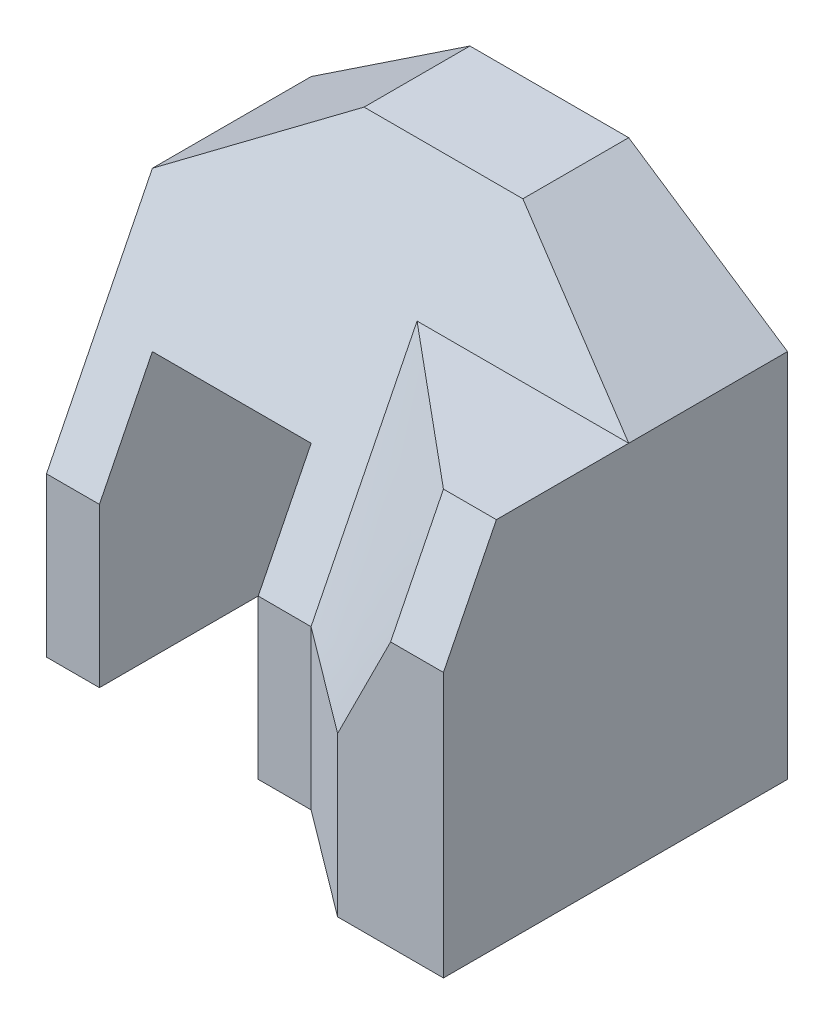
ISO-10303-21;
HEADER;
FILE_DESCRIPTION(('STEP AP214'),'2;1');
FILE_NAME('part.step','',(''),(''),'','','');
FILE_SCHEMA(('AUTOMOTIVE_DESIGN { 1 0 10303 214 1 1 1 1 }'));
ENDSEC;
DATA;
#1=APPLICATION_CONTEXT('core data for automotive mechanical design processes');
#2=APPLICATION_PROTOCOL_DEFINITION('international standard','automotive_design',2000,#1);
#3=PRODUCT_CONTEXT('',#1,'mechanical');
#4=PRODUCT('Part','Part','',(#3));
#5=PRODUCT_RELATED_PRODUCT_CATEGORY('part','',(#4));
#6=PRODUCT_DEFINITION_FORMATION('','',#4);
#7=PRODUCT_DEFINITION_CONTEXT('part definition',#1,'design');
#8=PRODUCT_DEFINITION('design','',#6,#7);
#9=PRODUCT_DEFINITION_SHAPE('','',#8);
#10=(LENGTH_UNIT() NAMED_UNIT(*) SI_UNIT(.MILLI.,.METRE.));
#11=(NAMED_UNIT(*) PLANE_ANGLE_UNIT() SI_UNIT($,.RADIAN.));
#12=(NAMED_UNIT(*) SI_UNIT($,.STERADIAN.) SOLID_ANGLE_UNIT());
#13=UNCERTAINTY_MEASURE_WITH_UNIT(LENGTH_MEASURE(1.E-05),#10,'distance_accuracy_value','');
#14=(GEOMETRIC_REPRESENTATION_CONTEXT(3) GLOBAL_UNCERTAINTY_ASSIGNED_CONTEXT((#13)) GLOBAL_UNIT_ASSIGNED_CONTEXT((#10,
#11,#12)) REPRESENTATION_CONTEXT('',''));
#15=CARTESIAN_POINT('',(0.,0.,0.));
#16=DIRECTION('',(0.,0.,1.));
#17=DIRECTION('',(1.,0.,0.));
#18=AXIS2_PLACEMENT_3D('',#15,#16,#17);
#19=CARTESIAN_POINT('',(0.5,0.5,4.0000538119005));
#20=DIRECTION('',(0.,0.,1.));
#21=DIRECTION('',(0.,-1.,0.));
#22=AXIS2_PLACEMENT_3D('',#19,#20,#21);
#23=PLANE('',#22);
#24=DIRECTION('',(0.,-1.,0.));
#25=VECTOR('',#24,1.);
#26=CARTESIAN_POINT('',(2.5,-0.5,4.0000538119005));
#27=LINE('',#26,#25);
#28=CARTESIAN_POINT('',(2.4999927075767,-1.49874744849598,4.00005671380062));
#29=VERTEX_POINT('',#28);
#30=CARTESIAN_POINT('',(2.5,-4.5,4.0000538119005));
#31=VERTEX_POINT('',#30);
#32=EDGE_CURVE('E185',#29,#31,#27,.T.);
#33=ORIENTED_EDGE('',*,*,#32,.T.);
#34=DIRECTION('',(1.,0.,0.));
#35=VECTOR('',#34,1.);
#36=CARTESIAN_POINT('',(0.5,-4.5,4.0000538119005));
#37=LINE('',#36,#35);
#38=CARTESIAN_POINT('',(4.5,-4.5,4.0000538119005));
#39=VERTEX_POINT('',#38);
#40=EDGE_CURVE('E184',#31,#39,#37,.T.);
#41=ORIENTED_EDGE('',*,*,#40,.T.);
#42=DIRECTION('',(0.,-1.,0.));
#43=VECTOR('',#42,1.);
#44=CARTESIAN_POINT('',(4.5,0.5,4.0000538119005));
#45=LINE('',#44,#43);
#46=CARTESIAN_POINT('',(4.5,0.5,4.0000538119005));
#47=VERTEX_POINT('',#46);
#48=EDGE_CURVE('E301',#47,#39,#45,.T.);
#49=ORIENTED_EDGE('',*,*,#48,.F.);
#50=DIRECTION('',(1.,0.,0.));
#51=VECTOR('',#50,1.);
#52=CARTESIAN_POINT('',(0.5,0.5,4.0000538119005));
#53=LINE('',#52,#51);
#54=CARTESIAN_POINT('',(3.50087116083465,0.499961528603174,3.99997320546575));
#55=VERTEX_POINT('',#54);
#56=EDGE_CURVE('E255',#55,#47,#53,.T.);
#57=ORIENTED_EDGE('',*,*,#56,.F.);
#58=CARTESIAN_POINT('',(2.49958350428957,-1.4997570487343,4.00056285003889));
#59=CARTESIAN_POINT('',(2.54149641947536,-1.41656131667034,4.0002647448763));
#60=CARTESIAN_POINT('',(2.58332355642664,-1.33332224784875,4.00006830762727));
#61=CARTESIAN_POINT('',(2.66686287394525,-1.1667770529191,3.99981593232635));
#62=CARTESIAN_POINT('',(2.70857504409917,-1.08347092156603,3.99976000660928));
#63=CARTESIAN_POINT('',(2.79193598144681,-0.916821249116581,3.99972584707898));
#64=CARTESIAN_POINT('',(2.83358474502591,-0.83347770621413,3.99974761754043));
#65=CARTESIAN_POINT('',(2.91683555384636,-0.666763306704454,3.99984828655163));
#66=CARTESIAN_POINT('',(2.95843759722138,-0.583392449166699,3.99992718730757));
#67=CARTESIAN_POINT('',(3.04160691534012,-0.416630814851586,4.00012731149325));
#68=CARTESIAN_POINT('',(3.08317418918512,-0.333240037626857,4.00024853598502));
#69=CARTESIAN_POINT('',(3.16631123059478,-0.166460721498398,4.00048756639654));
#70=CARTESIAN_POINT('',(3.20788099813492,-0.0830721825815888,4.00060537234566));
#71=CARTESIAN_POINT('',(3.29110568429374,0.0836538002768182,4.00073623927426));
#72=CARTESIAN_POINT('',(3.33276059509661,0.166991248069248,4.00074930947104));
#73=CARTESIAN_POINT('',(3.41637748907368,0.333487028918499,4.00040015168831));
#74=CARTESIAN_POINT('',(3.4583394002091,0.416645398421039,4.00003800911597));
#75=CARTESIAN_POINT('',(3.50057335062451,0.499665551753779,3.99935306678541));
#76=B_SPLINE_CURVE_WITH_KNOTS('',3,(#58,#59,#60,#61,#62,#63,#64,#65,#66,#67,#68,#69,#70,#71,#72,
#73,#74,#75),.UNSPECIFIED.,.F.,.F.,(4,2,2,2,2,2,2,2,4),(0.,0.279471952475803,0.558968437544278,
0.838480300176707,1.11800295731927,1.3975326291114,1.67705989800465,1.95656256669659,
2.23600162804104),.UNSPECIFIED.);
#77=EDGE_CURVE('E400',#55,#29,#76,.F.);
#78=ORIENTED_EDGE('',*,*,#77,.T.);
#79=EDGE_LOOP('',(#33,#41,#49,#57,#78));
#80=FACE_BOUND('',#79,.T.);
#81=ADVANCED_FACE('F33',(#80),#23,.T.);
#82=CARTESIAN_POINT('',(0.5,2.5,3.0000538119005));
#83=DIRECTION('',(0.,0.447213595499958,0.894427190999916));
#84=DIRECTION('',(0.,-0.894427190999916,0.447213595499958));
#85=AXIS2_PLACEMENT_3D('',#82,#83,#84);
#86=PLANE('',#85);
#87=DIRECTION('',(1.,0.,0.));
#88=VECTOR('',#87,1.);
#89=CARTESIAN_POINT('',(0.5,2.5,3.0000538119005));
#90=LINE('',#89,#88);
#91=CARTESIAN_POINT('',(3.49970849320657,2.50001145009092,3.00007780244424));
#92=VERTEX_POINT('',#91);
#93=CARTESIAN_POINT('',(4.5,2.5,3.0000538119005));
#94=VERTEX_POINT('',#93);
#95=EDGE_CURVE('E250',#92,#94,#90,.T.);
#96=ORIENTED_EDGE('',*,*,#95,.F.);
#97=CARTESIAN_POINT('',(3.5005733506245,0.499665551753777,3.99935306678541));
#98=CARTESIAN_POINT('',(3.49986743317037,0.583416434472831,3.95854628151296));
#99=CARTESIAN_POINT('',(3.49956574355038,0.666924741373819,3.91724884215407));
#100=CARTESIAN_POINT('',(3.49938095115662,0.833697184507774,3.83414236932439));
#101=CARTESIAN_POINT('',(3.49949788610719,0.916961298058577,3.79233329008554));
#102=CARTESIAN_POINT('',(3.49976046344427,1.08347304955096,3.70867991054064));
#103=CARTESIAN_POINT('',(3.49990610642543,1.1667206871155,3.66683560952288));
#104=CARTESIAN_POINT('',(3.50008517149017,1.33328256351635,3.58328359292611));
#105=CARTESIAN_POINT('',(3.50011859604767,1.41659680084393,3.54157587435632));
#106=CARTESIAN_POINT('',(3.50015611184294,1.58324203151882,3.45819646557547));
#107=CARTESIAN_POINT('',(3.50016020340609,1.66657302467001,3.41652477496992));
#108=CARTESIAN_POINT('',(3.50015633309681,1.83324196425395,3.33319616426182));
#109=CARTESIAN_POINT('',(3.50014837127765,1.91657991065433,3.29153924409482));
#110=CARTESIAN_POINT('',(3.50011039051209,2.08326864846417,3.20825237253051));
#111=CARTESIAN_POINT('',(3.50008037169786,2.16661943979366,3.16662242097311));
#112=CARTESIAN_POINT('',(3.49998219005013,2.33334327272151,3.08340913720679));
#113=CARTESIAN_POINT('',(3.49991402757998,2.41671631410034,3.04182580455757));
#114=CARTESIAN_POINT('',(3.4998187497045,2.50010572735229,3.00027533474143));
#115=B_SPLINE_CURVE_WITH_KNOTS('',3,(#97,#98,#99,#100,#101,#102,#103,#104,#105,#106,#107,#108,
#109,#110,#111,#112,#113,#114),.UNSPECIFIED.,.F.,.F.,(4,2,2,2,2,2,2,2,4),(0.,0.279487304548323,
0.558999795717704,0.838518077312864,1.11803019674219,1.39753921569574,1.67704699949379,
1.95655310846118,2.2360565549171),.UNSPECIFIED.);
#116=EDGE_CURVE('E342',#92,#55,#115,.F.);
#117=ORIENTED_EDGE('',*,*,#116,.T.);
#118=ORIENTED_EDGE('',*,*,#56,.T.);
#119=DIRECTION('',(0.,-0.894427190999916,0.447213595499958));
#120=VECTOR('',#119,1.);
#121=CARTESIAN_POINT('',(4.5,2.5,3.0000538119005));
#122=LINE('',#121,#120);
#123=EDGE_CURVE('E447',#94,#47,#122,.T.);
#124=ORIENTED_EDGE('',*,*,#123,.F.);
#125=EDGE_LOOP('',(#96,#117,#118,#124));
#126=FACE_BOUND('',#125,.T.);
#127=ADVANCED_FACE('F318',(#126),#86,.T.);
#128=CARTESIAN_POINT('',(0.5,2.5,0.500000000000001));
#129=DIRECTION('',(0.,1.,0.));
#130=DIRECTION('',(0.,0.,1.));
#131=AXIS2_PLACEMENT_3D('',#128,#129,#130);
#132=PLANE('',#131);
#133=CARTESIAN_POINT('',(3.4002341453916,2.50000331944349,2.91692550743889));
#134=CARTESIAN_POINT('',(3.35551781353747,2.49996711745501,2.87953352486206));
#135=CARTESIAN_POINT('',(3.31078156584035,2.49994238853837,2.8421653748496));
#136=CARTESIAN_POINT('',(3.22128016192815,2.49990979368912,2.76746440660837));
#137=CARTESIAN_POINT('',(3.17651500594038,2.49990192762549,2.73013158810733));
#138=CARTESIAN_POINT('',(3.08696622391711,2.49989697496073,2.65548854434524));
#139=CARTESIAN_POINT('',(3.04218259796945,2.49989988830892,2.6181783189788));
#140=CARTESIAN_POINT('',(2.95260480996369,2.49991186321713,2.54357075338038));
#141=CARTESIAN_POINT('',(2.90781064793283,2.49992092476143,2.50627341311568));
#142=CARTESIAN_POINT('',(2.8182180563226,2.49994153925452,2.43168395557095));
#143=CARTESIAN_POINT('',(2.77341962674776,2.4999530922007,2.39439183828548));
#144=CARTESIAN_POINT('',(2.68382303888505,2.49997604120783,2.31980727695089));
#145=CARTESIAN_POINT('',(2.63902488059718,2.49998743726879,2.28251483290178));
#146=CARTESIAN_POINT('',(2.54943197228685,2.50000824276492,2.20792578450191));
#147=CARTESIAN_POINT('',(2.50463722226686,2.50001765219866,2.17062918014817));
#148=CARTESIAN_POINT('',(2.41505267253215,2.50003358344229,2.09602992121213));
#149=CARTESIAN_POINT('',(2.3702628728232,2.50004010524885,2.05872726662291));
#150=CARTESIAN_POINT('',(2.32547635478394,2.50004473273555,2.02142067150619));
#151=B_SPLINE_CURVE_WITH_KNOTS('',3,(#133,#134,#135,#136,#137,#138,#139,#140,#141,#142,#143,
#144,#145,#146,#147,#148,#149,#150),.UNSPECIFIED.,.F.,.F.,(4,2,2,2,2,2,2,2,4),(0.,
0.174869655202873,0.349737951676011,0.524605425960433,0.699472452921211,0.874339296478271,
1.04920614143477,1.22407311240975,1.39894028495571),.UNSPECIFIED.);
#152=CARTESIAN_POINT('',(2.32553449668896,2.50001118319096,2.02135090023035));
#153=VERTEX_POINT('',#152);
#154=CARTESIAN_POINT('',(3.40018828035431,2.4999998757176,2.91698054848424));
#155=VERTEX_POINT('',#154);
#156=EDGE_CURVE('E366',#153,#155,#151,.F.);
#157=ORIENTED_EDGE('',*,*,#156,.T.);
#158=CARTESIAN_POINT('',(3.49981743585071,2.50010572569796,3.0002742340101));
#159=CARTESIAN_POINT('',(3.49566977331897,2.50010050323937,2.99679937097509));
#160=CARTESIAN_POINT('',(3.49152188772414,2.50009540903627,2.99332477400411));
#161=CARTESIAN_POINT('',(3.48322568826343,2.50008547045015,2.98637610349199));
#162=CARTESIAN_POINT('',(3.47907737439819,2.50008062606677,2.98290202995009));
#163=CARTESIAN_POINT('',(3.47078032988359,2.50007118042048,2.97595439226038));
#164=CARTESIAN_POINT('',(3.46663159923482,2.50006657915723,2.97248082811185));
#165=CARTESIAN_POINT('',(3.45833373244222,2.50005761316575,2.96553419541041));
#166=CARTESIAN_POINT('',(3.45418459629896,2.50005324843719,2.96206112685683));
#167=CARTESIAN_POINT('',(3.44588592966463,2.50004474901272,2.95511547172138));
#168=CARTESIAN_POINT('',(3.44173639917411,2.50004061431649,2.95164288513889));
#169=CARTESIAN_POINT('',(3.43343695483206,2.50003256854773,2.94469818051729));
#170=CARTESIAN_POINT('',(3.42928704098103,2.5000286574749,2.94122606247759));
#171=CARTESIAN_POINT('',(3.42098684076291,2.50002105262705,2.93428228168769));
#172=CARTESIAN_POINT('',(3.41683655439628,2.50001735885177,2.93081061893694));
#173=CARTESIAN_POINT('',(3.40853561979444,2.50001018238722,2.92386773570866));
#174=CARTESIAN_POINT('',(3.40438497155966,2.50000669969771,2.92039651523063));
#175=CARTESIAN_POINT('',(3.4002341453916,2.50000331944349,2.91692550743889));
#176=B_SPLINE_CURVE_WITH_KNOTS('',3,(#158,#159,#160,#161,#162,#163,#164,#165,#166,#167,#168,
#169,#170,#171,#172,#173,#174,#175),.UNSPECIFIED.,.F.,.F.,(4,2,2,2,2,2,2,2,4),(0.,
0.0162326905725323,0.0324653571359733,0.0486980006090778,0.064930621879698,0.0811632218057955,
0.097395801216407,0.113628360912604,0.129860901668391),.UNSPECIFIED.);
#177=EDGE_CURVE('E357',#155,#92,#176,.F.);
#178=ORIENTED_EDGE('',*,*,#177,.T.);
#179=ORIENTED_EDGE('',*,*,#95,.T.);
#180=DIRECTION('',(0.,0.,1.));
#181=VECTOR('',#180,1.);
#182=CARTESIAN_POINT('',(4.5,2.5,0.500000000000001));
#183=LINE('',#182,#181);
#184=CARTESIAN_POINT('',(4.5,2.5,0.500000000000001));
#185=VERTEX_POINT('',#184);
#186=EDGE_CURVE('E403',#185,#94,#183,.T.);
#187=ORIENTED_EDGE('',*,*,#186,.F.);
#188=DIRECTION('',(1.,0.,0.));
#189=VECTOR('',#188,1.);
#190=CARTESIAN_POINT('',(0.5,2.5,0.500000000000001));
#191=LINE('',#190,#189);
#192=CARTESIAN_POINT('',(0.501351919989517,2.50000853869827,0.499995730650865));
#193=VERTEX_POINT('',#192);
#194=EDGE_CURVE('E174',#193,#185,#191,.T.);
#195=ORIENTED_EDGE('',*,*,#194,.F.);
#196=CARTESIAN_POINT('',(2.32547635478394,2.50004473273555,2.02142067150619));
#197=CARTESIAN_POINT('',(2.24939694099326,2.50005325284452,1.95804981899506));
#198=CARTESIAN_POINT('',(2.17332758276244,2.50005597006414,1.8946668977488));
#199=CARTESIAN_POINT('',(2.02120302848641,2.50005314338351,1.76788374633175));
#200=CARTESIAN_POINT('',(1.94514783247041,2.50004759946641,1.70448351612591));
#201=CARTESIAN_POINT('',(1.79304587495392,2.5000315951544,1.57767275966668));
#202=CARTESIAN_POINT('',(1.71699911346341,2.50002113475372,1.51426223340131));
#203=CARTESIAN_POINT('',(1.56490548075494,2.50000027689608,1.38744131123372));
#204=CARTESIAN_POINT('',(1.48885860953697,2.49998987943913,1.32403091533151));
#205=CARTESIAN_POINT('',(1.33675715739893,2.49997357886892,1.19721953605873));
#206=CARTESIAN_POINT('',(1.26070257648726,2.49996767575082,1.13381855267809));
#207=CARTESIAN_POINT('',(1.10858047969692,2.49996341100161,1.00703238166271));
#208=CARTESIAN_POINT('',(1.03251296384169,2.49996504935699,0.943647193999868));
#209=CARTESIAN_POINT('',(0.880362968031575,2.49997704966812,0.816895089037596));
#210=CARTESIAN_POINT('',(0.804280488106648,2.49998741160659,0.753528171702209));
#211=CARTESIAN_POINT('',(0.652103777877846,2.50001498974235,0.626808698261892));
#212=CARTESIAN_POINT('',(0.576009547593082,2.50003220592861,0.56345614213401));
#213=CARTESIAN_POINT('',(0.499911001869605,2.50005191460052,0.500108772891251));
#214=B_SPLINE_CURVE_WITH_KNOTS('',3,(#196,#197,#198,#199,#200,#201,#202,#203,#204,#205,#206,
#207,#208,#209,#210,#211,#212,#213),.UNSPECIFIED.,.F.,.F.,(4,2,2,2,2,2,2,2,4),(0.,
0.297044570667198,0.594089747462085,0.891135272555297,1.18818079979485,1.48522600703011,
1.78227068206009,2.07931476844007,2.37635837670744),.UNSPECIFIED.);
#215=EDGE_CURVE('E374',#193,#153,#214,.F.);
#216=ORIENTED_EDGE('',*,*,#215,.T.);
#217=EDGE_LOOP('',(#157,#178,#179,#187,#195,#216));
#218=FACE_BOUND('',#217,.T.);
#219=ADVANCED_FACE('F328',(#218),#132,.T.);
#220=CARTESIAN_POINT('',(0.,0.,2.5));
#221=DIRECTION('',(0.,0.,-1.));
#222=DIRECTION('',(-1.,0.,0.));
#223=AXIS2_PLACEMENT_3D('',#220,#221,#222);
#224=PLANE('',#223);
#225=DIRECTION('',(0.,1.,0.));
#226=VECTOR('',#225,1.);
#227=CARTESIAN_POINT('',(0.5,-4.5,2.5));
#228=LINE('',#227,#226);
#229=CARTESIAN_POINT('',(0.5,-4.5,2.5));
#230=VERTEX_POINT('',#229);
#231=CARTESIAN_POINT('',(0.5,-1.50031001702587,2.5018984009075));
#232=VERTEX_POINT('',#231);
#233=EDGE_CURVE('E164',#230,#232,#228,.T.);
#234=ORIENTED_EDGE('',*,*,#233,.T.);
#235=DIRECTION('',(-1.,0.,0.));
#236=VECTOR('',#235,1.);
#237=CARTESIAN_POINT('',(4.5,-1.5,2.5));
#238=LINE('',#237,#236);
#239=CARTESIAN_POINT('',(-0.499999999999999,-1.5,2.5));
#240=VERTEX_POINT('',#239);
#241=EDGE_CURVE('E242',#232,#240,#238,.T.);
#242=ORIENTED_EDGE('',*,*,#241,.T.);
#243=DIRECTION('',(0.,-1.,0.));
#244=VECTOR('',#243,1.);
#245=CARTESIAN_POINT('',(-0.499999999999999,0.500000000000001,2.5));
#246=LINE('',#245,#244);
#247=CARTESIAN_POINT('',(-0.499999999999998,-4.5,2.5));
#248=VERTEX_POINT('',#247);
#249=EDGE_CURVE('E60',#240,#248,#246,.T.);
#250=ORIENTED_EDGE('',*,*,#249,.T.);
#251=DIRECTION('',(1.,0.,0.));
#252=VECTOR('',#251,1.);
#253=CARTESIAN_POINT('',(-0.499999999999998,-4.5,2.5));
#254=LINE('',#253,#252);
#255=EDGE_CURVE('E182',#248,#230,#254,.T.);
#256=ORIENTED_EDGE('',*,*,#255,.T.);
#257=EDGE_LOOP('',(#234,#242,#250,#256));
#258=FACE_BOUND('',#257,.T.);
#259=ADVANCED_FACE('F187',(#258),#224,.F.);
#260=CARTESIAN_POINT('',(-4.5,-4.5,2.5));
#261=DIRECTION('',(1.,0.,0.));
#262=DIRECTION('',(0.,0.,-1.));
#263=AXIS2_PLACEMENT_3D('',#260,#261,#262);
#264=PLANE('',#263);
#265=DIRECTION('',(0.,-1.,0.));
#266=VECTOR('',#265,1.);
#267=CARTESIAN_POINT('',(-4.5,-4.5,2.5));
#268=LINE('',#267,#266);
#269=CARTESIAN_POINT('',(-4.5,-1.5,2.5));
#270=VERTEX_POINT('',#269);
#271=CARTESIAN_POINT('',(-4.5,-4.5,2.5));
#272=VERTEX_POINT('',#271);
#273=EDGE_CURVE('E104',#270,#272,#268,.T.);
#274=ORIENTED_EDGE('',*,*,#273,.F.);
#275=DIRECTION('',(0.,-0.894427190999916,0.447213595499958));
#276=VECTOR('',#275,1.);
#277=CARTESIAN_POINT('',(-4.5,-1.5,2.5));
#278=LINE('',#277,#276);
#279=CARTESIAN_POINT('',(-4.5,2.5,0.5));
#280=VERTEX_POINT('',#279);
#281=EDGE_CURVE('E52',#280,#270,#278,.T.);
#282=ORIENTED_EDGE('',*,*,#281,.F.);
#283=DIRECTION('',(0.,0.,-1.));
#284=VECTOR('',#283,1.);
#285=CARTESIAN_POINT('',(-4.5,2.5,2.5));
#286=LINE('',#285,#284);
#287=CARTESIAN_POINT('',(-4.5,2.5,-2.5));
#288=VERTEX_POINT('',#287);
#289=EDGE_CURVE('E99',#280,#288,#286,.T.);
#290=ORIENTED_EDGE('',*,*,#289,.T.);
#291=DIRECTION('',(0.,-1.,0.));
#292=VECTOR('',#291,1.);
#293=CARTESIAN_POINT('',(-4.5,-4.5,-2.5));
#294=LINE('',#293,#292);
#295=CARTESIAN_POINT('',(-4.5,-4.5,-2.5));
#296=VERTEX_POINT('',#295);
#297=EDGE_CURVE('E195',#288,#296,#294,.T.);
#298=ORIENTED_EDGE('',*,*,#297,.T.);
#299=DIRECTION('',(0.,0.,-1.));
#300=VECTOR('',#299,1.);
#301=CARTESIAN_POINT('',(-4.5,-4.5,2.5));
#302=LINE('',#301,#300);
#303=EDGE_CURVE('E44',#272,#296,#302,.T.);
#304=ORIENTED_EDGE('',*,*,#303,.F.);
#305=EDGE_LOOP('',(#274,#282,#290,#298,#304));
#306=FACE_BOUND('',#305,.T.);
#307=ADVANCED_FACE('F35',(#306),#264,.F.);
#308=CARTESIAN_POINT('',(-4.5,-4.5,2.5));
#309=DIRECTION('',(0.,1.,0.));
#310=DIRECTION('',(0.,0.,1.));
#311=AXIS2_PLACEMENT_3D('',#308,#309,#310);
#312=PLANE('',#311);
#313=DIRECTION('',(1.,0.,0.));
#314=VECTOR('',#313,1.);
#315=CARTESIAN_POINT('',(-4.5,-4.5,-2.5));
#316=LINE('',#315,#314);
#317=CARTESIAN_POINT('',(-3.5,-4.5,-2.5));
#318=VERTEX_POINT('',#317);
#319=EDGE_CURVE('E197',#296,#318,#316,.T.);
#320=ORIENTED_EDGE('',*,*,#319,.T.);
#321=DIRECTION('',(0.,0.,-1.));
#322=VECTOR('',#321,1.);
#323=CARTESIAN_POINT('',(-3.5,-4.5,2.5));
#324=LINE('',#323,#322);
#325=CARTESIAN_POINT('',(-3.5,-4.5,2.5));
#326=VERTEX_POINT('',#325);
#327=EDGE_CURVE('E235',#326,#318,#324,.T.);
#328=ORIENTED_EDGE('',*,*,#327,.F.);
#329=DIRECTION('',(1.,0.,0.));
#330=VECTOR('',#329,1.);
#331=CARTESIAN_POINT('',(-4.5,-4.5,2.5));
#332=LINE('',#331,#330);
#333=EDGE_CURVE('E279',#272,#326,#332,.T.);
#334=ORIENTED_EDGE('',*,*,#333,.F.);
#335=ORIENTED_EDGE('',*,*,#303,.T.);
#336=EDGE_LOOP('',(#320,#328,#334,#335));
#337=FACE_BOUND('',#336,.T.);
#338=ADVANCED_FACE('F472',(#337),#312,.F.);
#339=CARTESIAN_POINT('',(-3.5,-4.5,2.5));
#340=DIRECTION('',(-1.,0.,0.));
#341=DIRECTION('',(0.,0.,1.));
#342=AXIS2_PLACEMENT_3D('',#339,#340,#341);
#343=PLANE('',#342);
#344=DIRECTION('',(0.,0.,-1.));
#345=VECTOR('',#344,1.);
#346=CARTESIAN_POINT('',(-3.5,0.500000000000001,2.5));
#347=LINE('',#346,#345);
#348=CARTESIAN_POINT('',(-3.5,0.500000000000001,1.5));
#349=VERTEX_POINT('',#348);
#350=CARTESIAN_POINT('',(-3.5,0.500000000000001,-2.5));
#351=VERTEX_POINT('',#350);
#352=EDGE_CURVE('E233',#349,#351,#347,.T.);
#353=ORIENTED_EDGE('',*,*,#352,.F.);
#354=DIRECTION('',(0.,-0.894427190999916,0.447213595499958));
#355=VECTOR('',#354,1.);
#356=CARTESIAN_POINT('',(-3.5,-3.9,3.7));
#357=LINE('',#356,#355);
#358=CARTESIAN_POINT('',(-3.5,-1.5,2.5));
#359=VERTEX_POINT('',#358);
#360=EDGE_CURVE('E198',#349,#359,#357,.T.);
#361=ORIENTED_EDGE('',*,*,#360,.T.);
#362=DIRECTION('',(0.,1.,0.));
#363=VECTOR('',#362,1.);
#364=CARTESIAN_POINT('',(-3.5,-4.5,2.5));
#365=LINE('',#364,#363);
#366=EDGE_CURVE('E191',#326,#359,#365,.T.);
#367=ORIENTED_EDGE('',*,*,#366,.F.);
#368=ORIENTED_EDGE('',*,*,#327,.T.);
#369=DIRECTION('',(0.,1.,0.));
#370=VECTOR('',#369,1.);
#371=CARTESIAN_POINT('',(-3.5,-4.5,-2.5));
#372=LINE('',#371,#370);
#373=EDGE_CURVE('E200',#318,#351,#372,.T.);
#374=ORIENTED_EDGE('',*,*,#373,.T.);
#375=EDGE_LOOP('',(#353,#361,#367,#368,#374));
#376=FACE_BOUND('',#375,.T.);
#377=ADVANCED_FACE('F286',(#376),#343,.F.);
#378=CARTESIAN_POINT('',(-3.5,0.500000000000001,2.5));
#379=DIRECTION('',(0.,1.,0.));
#380=DIRECTION('',(0.,0.,1.));
#381=AXIS2_PLACEMENT_3D('',#378,#379,#380);
#382=PLANE('',#381);
#383=DIRECTION('',(0.,0.,-1.));
#384=VECTOR('',#383,1.);
#385=CARTESIAN_POINT('',(-0.499999999999999,0.500000000000001,2.5));
#386=LINE('',#385,#384);
#387=CARTESIAN_POINT('',(-0.499999999999999,0.500000000000001,1.5));
#388=VERTEX_POINT('',#387);
#389=CARTESIAN_POINT('',(-0.499999999999999,0.500000000000001,-2.5));
#390=VERTEX_POINT('',#389);
#391=EDGE_CURVE('E231',#388,#390,#386,.T.);
#392=ORIENTED_EDGE('',*,*,#391,.F.);
#393=DIRECTION('',(-1.,0.,0.));
#394=VECTOR('',#393,1.);
#395=CARTESIAN_POINT('',(-3.5,0.500000000000001,1.5));
#396=LINE('',#395,#394);
#397=EDGE_CURVE('E273',#388,#349,#396,.T.);
#398=ORIENTED_EDGE('',*,*,#397,.T.);
#399=ORIENTED_EDGE('',*,*,#352,.T.);
#400=DIRECTION('',(1.,0.,0.));
#401=VECTOR('',#400,1.);
#402=CARTESIAN_POINT('',(-3.5,0.500000000000001,-2.5));
#403=LINE('',#402,#401);
#404=EDGE_CURVE('E203',#351,#390,#403,.T.);
#405=ORIENTED_EDGE('',*,*,#404,.T.);
#406=EDGE_LOOP('',(#392,#398,#399,#405));
#407=FACE_BOUND('',#406,.T.);
#408=ADVANCED_FACE('F293',(#407),#382,.F.);
#409=CARTESIAN_POINT('',(-0.499999999999999,0.500000000000001,2.5));
#410=DIRECTION('',(1.,0.,0.));
#411=DIRECTION('',(0.,1.,0.));
#412=AXIS2_PLACEMENT_3D('',#409,#410,#411);
#413=PLANE('',#412);
#414=ORIENTED_EDGE('',*,*,#249,.F.);
#415=DIRECTION('',(0.,0.894427190999916,-0.447213595499958));
#416=VECTOR('',#415,1.);
#417=CARTESIAN_POINT('',(-0.499999999999999,0.100000000000001,1.7));
#418=LINE('',#417,#416);
#419=EDGE_CURVE('E270',#240,#388,#418,.T.);
#420=ORIENTED_EDGE('',*,*,#419,.T.);
#421=ORIENTED_EDGE('',*,*,#391,.T.);
#422=DIRECTION('',(0.,-1.,0.));
#423=VECTOR('',#422,1.);
#424=CARTESIAN_POINT('',(-0.499999999999999,0.500000000000001,-2.5));
#425=LINE('',#424,#423);
#426=CARTESIAN_POINT('',(-0.499999999999998,-4.5,-2.5));
#427=VERTEX_POINT('',#426);
#428=EDGE_CURVE('E206',#390,#427,#425,.T.);
#429=ORIENTED_EDGE('',*,*,#428,.T.);
#430=DIRECTION('',(0.,0.,-1.));
#431=VECTOR('',#430,1.);
#432=CARTESIAN_POINT('',(-0.499999999999998,-4.5,2.5));
#433=LINE('',#432,#431);
#434=EDGE_CURVE('E229',#248,#427,#433,.T.);
#435=ORIENTED_EDGE('',*,*,#434,.F.);
#436=EDGE_LOOP('',(#414,#420,#421,#429,#435));
#437=FACE_BOUND('',#436,.T.);
#438=ADVANCED_FACE('F297',(#437),#413,.F.);
#439=CARTESIAN_POINT('',(-0.499999999999998,-4.5,2.5));
#440=DIRECTION('',(0.,1.,0.));
#441=DIRECTION('',(-1.,0.,0.));
#442=AXIS2_PLACEMENT_3D('',#439,#440,#441);
#443=PLANE('',#442);
#444=ORIENTED_EDGE('',*,*,#40,.F.);
#445=DIRECTION('',(0.799989668129933,0.,0.600013775579661));
#446=VECTOR('',#445,1.);
#447=CARTESIAN_POINT('',(0.5,-4.5,2.5));
#448=LINE('',#447,#446);
#449=EDGE_CURVE('E167',#230,#31,#448,.T.);
#450=ORIENTED_EDGE('',*,*,#449,.F.);
#451=ORIENTED_EDGE('',*,*,#255,.F.);
#452=ORIENTED_EDGE('',*,*,#434,.T.);
#453=DIRECTION('',(1.,0.,0.));
#454=VECTOR('',#453,1.);
#455=CARTESIAN_POINT('',(-0.499999999999998,-4.5,-2.5));
#456=LINE('',#455,#454);
#457=CARTESIAN_POINT('',(4.5,-4.5,-2.5));
#458=VERTEX_POINT('',#457);
#459=EDGE_CURVE('E208',#427,#458,#456,.T.);
#460=ORIENTED_EDGE('',*,*,#459,.T.);
#461=DIRECTION('',(0.,0.,-1.));
#462=VECTOR('',#461,1.);
#463=CARTESIAN_POINT('',(4.5,-4.5,2.5));
#464=LINE('',#463,#462);
#465=EDGE_CURVE('E226',#39,#458,#464,.T.);
#466=ORIENTED_EDGE('',*,*,#465,.F.);
#467=EDGE_LOOP('',(#444,#450,#451,#452,#460,#466));
#468=FACE_BOUND('',#467,.T.);
#469=ADVANCED_FACE('F180',(#468),#443,.F.);
#470=CARTESIAN_POINT('',(4.5,-4.5,2.5));
#471=DIRECTION('',(-1.,0.,0.));
#472=DIRECTION('',(0.,0.,1.));
#473=AXIS2_PLACEMENT_3D('',#470,#471,#472);
#474=PLANE('',#473);
#475=DIRECTION('',(0.,0.,-1.));
#476=VECTOR('',#475,1.);
#477=CARTESIAN_POINT('',(4.5,2.5,2.5));
#478=LINE('',#477,#476);
#479=CARTESIAN_POINT('',(4.5,2.5,-2.5));
#480=VERTEX_POINT('',#479);
#481=EDGE_CURVE('E224',#185,#480,#478,.T.);
#482=ORIENTED_EDGE('',*,*,#481,.F.);
#483=ORIENTED_EDGE('',*,*,#186,.T.);
#484=ORIENTED_EDGE('',*,*,#123,.T.);
#485=ORIENTED_EDGE('',*,*,#48,.T.);
#486=ORIENTED_EDGE('',*,*,#465,.T.);
#487=DIRECTION('',(0.,1.,0.));
#488=VECTOR('',#487,1.);
#489=CARTESIAN_POINT('',(4.5,-4.5,-2.5));
#490=LINE('',#489,#488);
#491=EDGE_CURVE('E210',#458,#480,#490,.T.);
#492=ORIENTED_EDGE('',*,*,#491,.T.);
#493=EDGE_LOOP('',(#482,#483,#484,#485,#486,#492));
#494=FACE_BOUND('',#493,.T.);
#495=ADVANCED_FACE('F454',(#494),#474,.F.);
#496=CARTESIAN_POINT('',(1.5,4.5,2.5));
#497=DIRECTION('',(-0.554700196225229,-0.832050294337844,0.));
#498=DIRECTION('',(0.832050294337844,-0.554700196225229,0.));
#499=AXIS2_PLACEMENT_3D('',#496,#497,#498);
#500=PLANE('',#499);
#501=DIRECTION('',(0.,0.,-1.));
#502=VECTOR('',#501,1.);
#503=CARTESIAN_POINT('',(1.5,4.5,2.5));
#504=LINE('',#503,#502);
#505=CARTESIAN_POINT('',(1.5,4.5,-0.5));
#506=VERTEX_POINT('',#505);
#507=CARTESIAN_POINT('',(1.5,4.5,-2.5));
#508=VERTEX_POINT('',#507);
#509=EDGE_CURVE('E222',#506,#508,#504,.T.);
#510=ORIENTED_EDGE('',*,*,#509,.F.);
#511=DIRECTION('',(0.801783725737273,-0.534522483824849,0.267261241912424));
#512=VECTOR('',#511,1.);
#513=CARTESIAN_POINT('',(2.14285714285714,4.07142857142857,-0.285714285714285));
#514=LINE('',#513,#512);
#515=EDGE_CURVE('E267',#506,#185,#514,.T.);
#516=ORIENTED_EDGE('',*,*,#515,.T.);
#517=ORIENTED_EDGE('',*,*,#481,.T.);
#518=DIRECTION('',(-0.832050294337844,0.554700196225229,0.));
#519=VECTOR('',#518,1.);
#520=CARTESIAN_POINT('',(1.5,4.5,-2.5));
#521=LINE('',#520,#519);
#522=EDGE_CURVE('E213',#480,#508,#521,.T.);
#523=ORIENTED_EDGE('',*,*,#522,.T.);
#524=EDGE_LOOP('',(#510,#516,#517,#523));
#525=FACE_BOUND('',#524,.T.);
#526=ADVANCED_FACE('F455',(#525),#500,.F.);
#527=CARTESIAN_POINT('',(-1.5,4.5,2.5));
#528=DIRECTION('',(0.,-1.,0.));
#529=DIRECTION('',(0.,0.,-1.));
#530=AXIS2_PLACEMENT_3D('',#527,#528,#529);
#531=PLANE('',#530);
#532=DIRECTION('',(0.,0.,-1.));
#533=VECTOR('',#532,1.);
#534=CARTESIAN_POINT('',(-1.5,4.5,2.5));
#535=LINE('',#534,#533);
#536=CARTESIAN_POINT('',(-1.5,4.5,-0.5));
#537=VERTEX_POINT('',#536);
#538=CARTESIAN_POINT('',(-1.5,4.5,-2.5));
#539=VERTEX_POINT('',#538);
#540=EDGE_CURVE('E189',#537,#539,#535,.T.);
#541=ORIENTED_EDGE('',*,*,#540,.F.);
#542=DIRECTION('',(-1.,0.,0.));
#543=VECTOR('',#542,1.);
#544=CARTESIAN_POINT('',(4.5,4.5,-0.5));
#545=LINE('',#544,#543);
#546=EDGE_CURVE('E245',#506,#537,#545,.T.);
#547=ORIENTED_EDGE('',*,*,#546,.F.);
#548=ORIENTED_EDGE('',*,*,#509,.T.);
#549=DIRECTION('',(-1.,0.,0.));
#550=VECTOR('',#549,1.);
#551=CARTESIAN_POINT('',(-1.5,4.5,-2.5));
#552=LINE('',#551,#550);
#553=EDGE_CURVE('E216',#508,#539,#552,.T.);
#554=ORIENTED_EDGE('',*,*,#553,.T.);
#555=EDGE_LOOP('',(#541,#547,#548,#554));
#556=FACE_BOUND('',#555,.T.);
#557=ADVANCED_FACE('F461',(#556),#531,.F.);
#558=CARTESIAN_POINT('',(-4.5,2.5,2.5));
#559=DIRECTION('',(0.554700196225229,-0.832050294337844,0.));
#560=DIRECTION('',(0.832050294337844,0.554700196225229,0.));
#561=AXIS2_PLACEMENT_3D('',#558,#559,#560);
#562=PLANE('',#561);
#563=ORIENTED_EDGE('',*,*,#289,.F.);
#564=DIRECTION('',(0.801783725737273,0.534522483824849,-0.267261241912424));
#565=VECTOR('',#564,1.);
#566=CARTESIAN_POINT('',(-4.92857142857143,2.21428571428571,0.642857142857143));
#567=LINE('',#566,#565);
#568=EDGE_CURVE('E244',#280,#537,#567,.T.);
#569=ORIENTED_EDGE('',*,*,#568,.T.);
#570=ORIENTED_EDGE('',*,*,#540,.T.);
#571=DIRECTION('',(-0.832050294337844,-0.554700196225229,0.));
#572=VECTOR('',#571,1.);
#573=CARTESIAN_POINT('',(-4.5,2.5,-2.5));
#574=LINE('',#573,#572);
#575=EDGE_CURVE('E219',#539,#288,#574,.T.);
#576=ORIENTED_EDGE('',*,*,#575,.T.);
#577=EDGE_LOOP('',(#563,#569,#570,#576));
#578=FACE_BOUND('',#577,.T.);
#579=ADVANCED_FACE('F489',(#578),#562,.F.);
#580=ORIENTED_EDGE('',*,*,#366,.T.);
#581=DIRECTION('',(-1.,0.,0.));
#582=VECTOR('',#581,1.);
#583=CARTESIAN_POINT('',(0.,-1.5,2.5));
#584=LINE('',#583,#582);
#585=EDGE_CURVE('E11',#359,#270,#584,.T.);
#586=ORIENTED_EDGE('',*,*,#585,.T.);
#587=ORIENTED_EDGE('',*,*,#273,.T.);
#588=ORIENTED_EDGE('',*,*,#333,.T.);
#589=EDGE_LOOP('',(#580,#586,#587,#588));
#590=FACE_BOUND('',#589,.T.);
#591=ADVANCED_FACE('F282',(#590),#224,.F.);
#592=CARTESIAN_POINT('',(0.,0.,-2.5));
#593=DIRECTION('',(0.,0.,-1.));
#594=DIRECTION('',(-1.,0.,0.));
#595=AXIS2_PLACEMENT_3D('',#592,#593,#594);
#596=PLANE('',#595);
#597=ORIENTED_EDGE('',*,*,#297,.F.);
#598=ORIENTED_EDGE('',*,*,#575,.F.);
#599=ORIENTED_EDGE('',*,*,#553,.F.);
#600=ORIENTED_EDGE('',*,*,#522,.F.);
#601=ORIENTED_EDGE('',*,*,#491,.F.);
#602=ORIENTED_EDGE('',*,*,#459,.F.);
#603=ORIENTED_EDGE('',*,*,#428,.F.);
#604=ORIENTED_EDGE('',*,*,#404,.F.);
#605=ORIENTED_EDGE('',*,*,#373,.F.);
#606=ORIENTED_EDGE('',*,*,#319,.F.);
#607=EDGE_LOOP('',(#597,#598,#599,#600,#601,#602,#603,#604,#605,#606));
#608=FACE_BOUND('',#607,.T.);
#609=ADVANCED_FACE('F398',(#608),#596,.T.);
#610=CARTESIAN_POINT('',(4.5,-1.5,2.5));
#611=DIRECTION('',(0.,-0.447213595499958,-0.894427190999916));
#612=DIRECTION('',(0.,0.894427190999916,-0.447213595499958));
#613=AXIS2_PLACEMENT_3D('',#610,#611,#612);
#614=PLANE('',#613);
#615=CARTESIAN_POINT('',(0.499911001869605,2.50005191460052,0.500108772891251));
#616=CARTESIAN_POINT('',(0.499946222567671,2.33336458188134,0.583399120249932));
#617=CARTESIAN_POINT('',(0.499975958550768,2.16668056756426,0.666696111466234));
#618=CARTESIAN_POINT('',(0.500024011315672,1.83331920000529,0.833304050366817));
#619=CARTESIAN_POINT('',(0.50004232808035,1.66664184677377,0.916614998071846));
#620=CARTESIAN_POINT('',(0.500067092546939,1.33329408023779,1.08325139154863));
#621=CARTESIAN_POINT('',(0.500073540231367,1.16662366694392,1.16657683734156));
#622=CARTESIAN_POINT('',(0.500078522328391,0.833287469682686,1.33323739380378));
#623=CARTESIAN_POINT('',(0.500077056733299,0.666621685719982,1.41657250448238));
#624=CARTESIAN_POINT('',(0.500073841662493,0.333290341763789,1.58324304360885));
#625=CARTESIAN_POINT('',(0.500072092186862,0.166624781770247,1.66657847205662));
#626=CARTESIAN_POINT('',(0.500091122859838,-0.166720107505926,1.83322210703091));
#627=CARTESIAN_POINT('',(0.500111903024496,-0.333399436798282,1.91653031353801));
#628=CARTESIAN_POINT('',(0.500031574498048,-0.666685484112505,2.08329494287047));
#629=CARTESIAN_POINT('',(0.499930464909401,-0.833292201590653,2.16675136678273));
#630=CARTESIAN_POINT('',(0.499867924578112,-1.16658711445339,2.33349350015589));
#631=CARTESIAN_POINT('',(0.49990649125422,-1.33327530827535,2.41677921274313));
#632=CARTESIAN_POINT('',(0.500145671544148,-1.50008497347067,2.49982196125965));
#633=B_SPLINE_CURVE_WITH_KNOTS('',3,(#615,#616,#617,#618,#619,#620,#621,#622,#623,#624,#625,
#626,#627,#628,#629,#630,#631,#632),.UNSPECIFIED.,.F.,.F.,(4,2,2,2,2,2,2,2,4),(0.,
0.559014803930617,1.11803044641102,1.67704691228382,2.23606392111965,2.79508076260609,
3.35409800238321,3.91311935854446,4.47213038391358),.UNSPECIFIED.);
#634=EDGE_CURVE('E175',#232,#193,#633,.F.);
#635=ORIENTED_EDGE('',*,*,#634,.T.);
#636=ORIENTED_EDGE('',*,*,#194,.T.);
#637=ORIENTED_EDGE('',*,*,#515,.F.);
#638=ORIENTED_EDGE('',*,*,#546,.T.);
#639=ORIENTED_EDGE('',*,*,#568,.F.);
#640=ORIENTED_EDGE('',*,*,#281,.T.);
#641=ORIENTED_EDGE('',*,*,#585,.F.);
#642=ORIENTED_EDGE('',*,*,#360,.F.);
#643=ORIENTED_EDGE('',*,*,#397,.F.);
#644=ORIENTED_EDGE('',*,*,#419,.F.);
#645=ORIENTED_EDGE('',*,*,#241,.F.);
#646=EDGE_LOOP('',(#635,#636,#637,#638,#639,#640,#641,#642,#643,#644,#645));
#647=FACE_BOUND('',#646,.T.);
#648=ADVANCED_FACE('F289',(#647),#614,.F.);
#649=CARTESIAN_POINT('',(3.59663915161607,-1.17566224473841,4.76361663781719));
#650=CARTESIAN_POINT('',(3.00393766906738,-1.3911266662551,4.33185431691682));
#651=CARTESIAN_POINT('',(2.39032462743585,-1.59439290752719,3.92564995697441));
#652=CARTESIAN_POINT('',(1.74618768589764,-1.77985387510573,3.55675169357929));
#653=CARTESIAN_POINT('',(1.11380544823699,-1.97217162443123,3.17348691348473));
#654=CARTESIAN_POINT('',(0.472629645353317,-2.15935989043329,2.80096956717839));
#655=CARTESIAN_POINT('',(3.5739984248781,-0.833026807948837,4.62642914749336));
#656=CARTESIAN_POINT('',(2.98362216593559,-1.0498475844147,4.19182495459725));
#657=CARTESIAN_POINT('',(2.37056779472141,-1.25343971063976,3.78493779158605));
#658=CARTESIAN_POINT('',(1.73698670462918,-1.44505814252132,3.40313824053154));
#659=CARTESIAN_POINT('',(1.10709995130513,-1.63883156368912,3.01682349696973));
#660=CARTESIAN_POINT('',(0.469423981466121,-1.82806136060409,2.64002867924384));
#661=CARTESIAN_POINT('',(3.55594098545304,-0.493064905185773,4.48363999553649));
#662=CARTESIAN_POINT('',(2.96757976156768,-0.711061096680664,4.04657304091536));
#663=CARTESIAN_POINT('',(2.35555498931243,-0.915253811012572,3.63842750927221));
#664=CARTESIAN_POINT('',(1.7301582782208,-1.11164637426538,3.24662506756122));
#665=CARTESIAN_POINT('',(1.10226116637961,-1.30658039782222,2.85787859812292));
#666=CARTESIAN_POINT('',(0.467969270023369,-1.49778420050788,2.47694778950279));
#667=CARTESIAN_POINT('',(3.54168708941036,-0.155321694370197,4.33620217951377));
#668=CARTESIAN_POINT('',(2.95623692994759,-0.375015974868862,3.89557734235677));
#669=CARTESIAN_POINT('',(2.34855890451338,-0.581744243866522,3.48211924721197));
#670=CARTESIAN_POINT('',(1.72322317863008,-0.778172381155702,3.09024226980675));
#671=CARTESIAN_POINT('',(1.09902819186376,-0.975265937092331,2.69697108904733));
#672=CARTESIAN_POINT('',(0.468972211769903,-1.16894064449939,2.31086317325759));
#673=CARTESIAN_POINT('',(3.52705077271621,0.379786478419482,4.0905743192569));
#674=CARTESIAN_POINT('',(2.94482226664703,0.15821293542179,3.64601199990036));
#675=CARTESIAN_POINT('',(2.33794154538461,-0.0489804189364901,3.23157944518451));
#676=CARTESIAN_POINT('',(1.71558818702434,-0.247148237923122,2.83605743909376));
#677=CARTESIAN_POINT('',(1.09529007851998,-0.446514930130572,2.4380235210328));
#678=CARTESIAN_POINT('',(0.469255730267099,-0.642535545362058,2.04700039499157));
#679=CARTESIAN_POINT('',(3.52863726363104,0.905431524595618,3.82511905723359));
#680=CARTESIAN_POINT('',(2.93548921508907,0.690227595013349,3.39390252616058));
#681=CARTESIAN_POINT('',(2.32982457112763,0.48232487555943,2.97798369029001));
#682=CARTESIAN_POINT('',(1.71089051887118,0.282162498826028,2.57828263224248));
#683=CARTESIAN_POINT('',(1.09230764333279,0.0817952728564897,2.17815236847128));
#684=CARTESIAN_POINT('',(0.469286666231491,-0.115983109182592,1.78344632132699));
#685=CARTESIAN_POINT('',(3.52947676398235,1.10208371271209,3.72543558971335));
#686=CARTESIAN_POINT('',(2.93341502409896,0.888579404474119,3.297780151778));
#687=CARTESIAN_POINT('',(2.3262158560669,0.681571807240833,2.88373680047224));
#688=CARTESIAN_POINT('',(1.70956641533221,0.480076765495657,2.4812435062339));
#689=CARTESIAN_POINT('',(1.0912408989891,0.279559416149889,2.08079869985785));
#690=CARTESIAN_POINT('',(0.469288544296756,0.0811576827525422,1.6847865898945));
#691=CARTESIAN_POINT('',(3.53001460028854,1.71096971378601,3.41991110834946));
#692=CARTESIAN_POINT('',(2.92704519734704,1.50149479994747,3.0006981677932));
#693=CARTESIAN_POINT('',(2.31737184594395,1.29593044922672,2.58967874606386));
#694=CARTESIAN_POINT('',(1.70443688871825,1.09226866615065,2.18264563611281));
#695=CARTESIAN_POINT('',(1.08847160391087,0.890374540947199,1.77931617129485));
#696=CARTESIAN_POINT('',(0.469308447782472,0.690345805627794,1.379895122394));
#697=CARTESIAN_POINT('',(3.52996960015778,2.32019569639277,3.11509896559415));
#698=CARTESIAN_POINT('',(2.92053071078393,2.114494578725,2.70379298601583));
#699=CARTESIAN_POINT('',(2.31032860338955,1.90923866320325,2.2934198061534));
#700=CARTESIAN_POINT('',(1.70018420342591,1.70394908564612,1.88297609667354));
#701=CARTESIAN_POINT('',(1.08601998021974,1.50100436091749,1.47744538698884));
#702=CARTESIAN_POINT('',(0.469331173546864,1.29953228220475,1.07500020552427));
#703=CARTESIAN_POINT('',(3.53023601001983,2.73209813913127,2.90856365580234));
#704=CARTESIAN_POINT('',(2.91661662545588,2.52883559783356,2.50236704814747));
#705=CARTESIAN_POINT('',(2.30589894071404,2.32388043011303,2.09262400330583));
#706=CARTESIAN_POINT('',(1.69787128849675,2.11735610623976,1.67959321956505));
#707=CARTESIAN_POINT('',(1.08438262977376,1.91401730963443,1.27323683970351));
#708=CARTESIAN_POINT('',(0.469296621672489,1.7116102826572,0.868832729057517));
#709=CARTESIAN_POINT('',(3.52852429860594,3.14515446426439,2.70444599197086));
#710=CARTESIAN_POINT('',(2.91446012852189,2.94215137631124,2.2987929980615));
#711=CARTESIAN_POINT('',(2.30226458929593,2.73805827417373,1.89085617661318));
#712=CARTESIAN_POINT('',(1.69477171715378,2.53122200111858,1.47717178841242));
#713=CARTESIAN_POINT('',(1.08290034073165,2.32693980756546,1.06883877745708));
#714=CARTESIAN_POINT('',(0.469229864643502,2.12370706909682,0.662704613505026));
#715=CARTESIAN_POINT('',(3.52698918885883,3.55810777369434,2.5001124868199));
#716=CARTESIAN_POINT('',(2.91181485275909,3.35575227041469,2.09581633003461));
#717=CARTESIAN_POINT('',(2.29905587609378,3.15198783394073,1.68856813787596));
#718=CARTESIAN_POINT('',(1.6917759036065,2.94502737175392,1.27462354520907));
#719=CARTESIAN_POINT('',(1.08138828145523,2.73987967114018,0.864477100182378));
#720=CARTESIAN_POINT('',(0.469134251722475,2.53582068782383,0.456611765421556));
#721=B_SPLINE_SURFACE_WITH_KNOTS('',5,5,((#649,#650,#651,#652,#653,#654),(#655,#656,#657,#658,
#659,#660),(#661,#662,#663,#664,#665,#666),(#667,#668,#669,#670,#671,#672),(#673,#674,#675,#676,
#677,#678),(#679,#680,#681,#682,#683,#684),(#685,#686,#687,#688,#689,#690),(#691,#692,#693,#694,
#695,#696),(#697,#698,#699,#700,#701,#702),(#703,#704,#705,#706,#707,#708),(#709,#710,#711,#712,
#713,#714),(#715,#716,#717,#718,#719,#720)),.UNSPECIFIED.,.F.,.F.,.F.,(6,3,3,6),(6,6),
(-2.37818458898029,-0.5365077646642,0.565617707840989,2.86923493306766),(-1.80159123529165,
2.01560473628314),.UNSPECIFIED.);
#722=CARTESIAN_POINT('',(0.500145671544148,-1.50008497347067,2.49982196125965));
#723=CARTESIAN_POINT('',(0.583439637654128,-1.50006231585393,2.5623712826179));
#724=CARTESIAN_POINT('',(0.666718662862893,-1.50003046062595,2.62494049513158));
#725=CARTESIAN_POINT('',(0.833279729198077,-1.49996850942105,2.7500752341295));
#726=CARTESIAN_POINT('',(0.916561770329906,-1.49993841344746,2.81264076060653));
#727=CARTESIAN_POINT('',(1.08316323756409,-1.49990013505283,2.93772576331182));
#728=CARTESIAN_POINT('',(1.16648266442987,-1.49989195310174,3.00024523852373));
#729=CARTESIAN_POINT('',(1.33317151212641,-1.49990486356045,3.12522270880306));
#730=CARTESIAN_POINT('',(1.41654093438061,-1.49992595684759,3.18768070197181));
#731=CARTESIAN_POINT('',(1.58332086863817,-1.49999228642155,3.31254587895681));
#732=CARTESIAN_POINT('',(1.66673138156187,-1.50003752327623,3.37495306154342));
#733=CARTESIAN_POINT('',(1.83355220855137,-1.50012809179217,3.49976695702563));
#734=CARTESIAN_POINT('',(1.91696252261666,-1.50017342345307,3.5621736699221));
#735=CARTESIAN_POINT('',(2.08370503673979,-1.50021869088526,3.68708199215204));
#736=CARTESIAN_POINT('',(2.16703724089602,-1.50021862918906,3.74958359599694));
#737=CARTESIAN_POINT('',(2.33349418380261,-1.5000974855872,3.87484036982207));
#738=CARTESIAN_POINT('',(2.41661894736166,-1.49997641892428,3.93759550687362));
#739=CARTESIAN_POINT('',(2.49958350428957,-1.4997570487343,4.0005628500389));
#740=B_SPLINE_CURVE_WITH_KNOTS('',3,(#722,#723,#724,#725,#726,#727,#728,#729,#730,#731,#732,
#733,#734,#735,#736,#737,#738,#739),.UNSPECIFIED.,.F.,.F.,(4,2,2,2,2,2,2,2,4),(0.,
0.312494364302107,0.624989320071647,0.937490977392293,1.25000200013147,1.56252037341682,
1.87503752124574,2.18753723360727,2.49999758601489),.UNSPECIFIED.);
#741=EDGE_CURVE('E170',#29,#232,#740,.F.);
#742=ORIENTED_EDGE('',*,*,#116,.F.);
#743=ORIENTED_EDGE('',*,*,#177,.F.);
#744=ORIENTED_EDGE('',*,*,#156,.F.);
#745=ORIENTED_EDGE('',*,*,#215,.F.);
#746=ORIENTED_EDGE('',*,*,#634,.F.);
#747=ORIENTED_EDGE('',*,*,#741,.F.);
#748=ORIENTED_EDGE('',*,*,#77,.F.);
#749=EDGE_LOOP('',(#742,#743,#744,#745,#746,#747,#748));
#750=FACE_BOUND('',#749,.T.);
#751=ADVANCED_FACE('F320',(#750),#721,.T.);
#752=CARTESIAN_POINT('',(0.499999999999999,-0.5,2.5));
#753=DIRECTION('',(0.600013775579661,0.,-0.799989668129933));
#754=DIRECTION('',(-0.799989668129933,0.,-0.600013775579661));
#755=AXIS2_PLACEMENT_3D('',#752,#753,#754);
#756=PLANE('',#755);
#757=ORIENTED_EDGE('',*,*,#741,.T.);
#758=ORIENTED_EDGE('',*,*,#233,.F.);
#759=ORIENTED_EDGE('',*,*,#449,.T.);
#760=ORIENTED_EDGE('',*,*,#32,.F.);
#761=EDGE_LOOP('',(#757,#758,#759,#760));
#762=FACE_BOUND('',#761,.T.);
#763=ADVANCED_FACE('F166',(#762),#756,.F.);
#764=CLOSED_SHELL('',(#81,#127,#219,#259,#307,#338,#377,#408,#438,#469,#495,#526,#557,#579,#591,
#609,#648,#751,#763));
#765=MANIFOLD_SOLID_BREP('B2',#764);
#766=ADVANCED_BREP_SHAPE_REPRESENTATION('',(#18,#765),#14);
#767=SHAPE_DEFINITION_REPRESENTATION(#9,#766);
ENDSEC;
END-ISO-10303-21;
